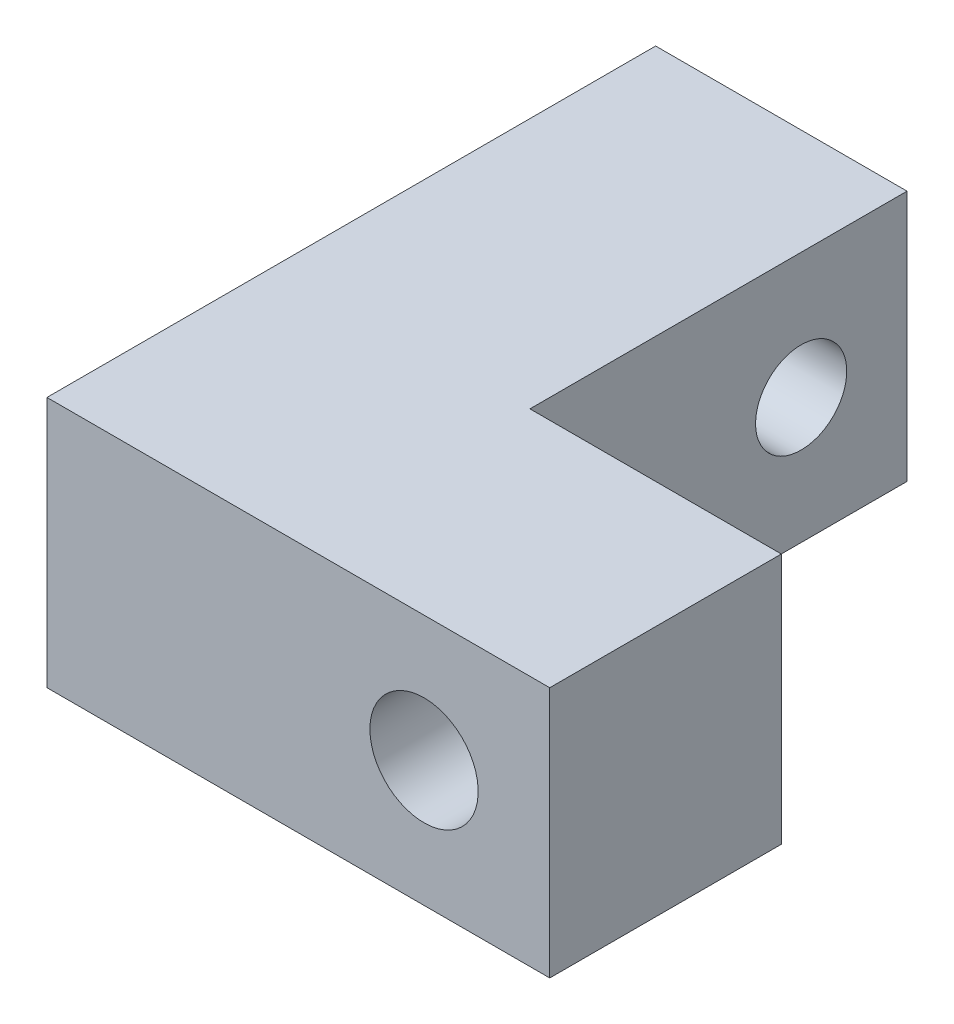
ISO-10303-21;
HEADER;
FILE_DESCRIPTION(('STEP AP214'),'2;1');
FILE_NAME('part.step','',(''),(''),'','','');
FILE_SCHEMA(('AUTOMOTIVE_DESIGN { 1 0 10303 214 1 1 1 1 }'));
ENDSEC;
DATA;
#1=APPLICATION_CONTEXT('core data for automotive mechanical design processes');
#2=APPLICATION_PROTOCOL_DEFINITION('international standard','automotive_design',2000,#1);
#3=PRODUCT_CONTEXT('',#1,'mechanical');
#4=PRODUCT('Part','Part','',(#3));
#5=PRODUCT_RELATED_PRODUCT_CATEGORY('part','',(#4));
#6=PRODUCT_DEFINITION_FORMATION('','',#4);
#7=PRODUCT_DEFINITION_CONTEXT('part definition',#1,'design');
#8=PRODUCT_DEFINITION('design','',#6,#7);
#9=PRODUCT_DEFINITION_SHAPE('','',#8);
#10=(LENGTH_UNIT() NAMED_UNIT(*) SI_UNIT(.MILLI.,.METRE.));
#11=(NAMED_UNIT(*) PLANE_ANGLE_UNIT() SI_UNIT($,.RADIAN.));
#12=(NAMED_UNIT(*) SI_UNIT($,.STERADIAN.) SOLID_ANGLE_UNIT());
#13=UNCERTAINTY_MEASURE_WITH_UNIT(LENGTH_MEASURE(1.E-05),#10,'distance_accuracy_value','');
#14=(GEOMETRIC_REPRESENTATION_CONTEXT(3) GLOBAL_UNCERTAINTY_ASSIGNED_CONTEXT((#13)) GLOBAL_UNIT_ASSIGNED_CONTEXT((#10,
#11,#12)) REPRESENTATION_CONTEXT('',''));
#15=CARTESIAN_POINT('',(0.,0.,0.));
#16=DIRECTION('',(0.,0.,1.));
#17=DIRECTION('',(1.,0.,0.));
#18=AXIS2_PLACEMENT_3D('',#15,#16,#17);
#19=CARTESIAN_POINT('',(19.05,19.05,23.8125));
#20=DIRECTION('',(-1.,0.,0.));
#21=DIRECTION('',(0.,0.,1.));
#22=AXIS2_PLACEMENT_3D('',#19,#20,#21);
#23=PLANE('',#22);
#24=DIRECTION('',(0.,0.,-1.));
#25=VECTOR('',#24,1.);
#26=CARTESIAN_POINT('',(19.05,0.,23.8125));
#27=LINE('',#26,#25);
#28=CARTESIAN_POINT('',(19.05,0.,23.8125));
#29=VERTEX_POINT('',#28);
#30=CARTESIAN_POINT('',(19.05,0.,6.2625));
#31=VERTEX_POINT('',#30);
#32=EDGE_CURVE('E137',#29,#31,#27,.T.);
#33=ORIENTED_EDGE('',*,*,#32,.T.);
#34=DIRECTION('',(0.,1.,0.));
#35=VECTOR('',#34,1.);
#36=CARTESIAN_POINT('',(19.05,19.05,6.2625));
#37=LINE('',#36,#35);
#38=CARTESIAN_POINT('',(19.05,19.05,6.2625));
#39=VERTEX_POINT('',#38);
#40=EDGE_CURVE('E180',#31,#39,#37,.T.);
#41=ORIENTED_EDGE('',*,*,#40,.T.);
#42=DIRECTION('',(0.,0.,-1.));
#43=VECTOR('',#42,1.);
#44=CARTESIAN_POINT('',(19.05,19.05,23.8125));
#45=LINE('',#44,#43);
#46=CARTESIAN_POINT('',(19.05,19.05,23.8125));
#47=VERTEX_POINT('',#46);
#48=EDGE_CURVE('E138',#47,#39,#45,.T.);
#49=ORIENTED_EDGE('',*,*,#48,.F.);
#50=DIRECTION('',(0.,-1.,0.));
#51=VECTOR('',#50,1.);
#52=CARTESIAN_POINT('',(19.05,19.05,23.8125));
#53=LINE('',#52,#51);
#54=EDGE_CURVE('E146',#47,#29,#53,.T.);
#55=ORIENTED_EDGE('',*,*,#54,.T.);
#56=EDGE_LOOP('',(#33,#41,#49,#55));
#57=FACE_BOUND('',#56,.T.);
#58=ADVANCED_FACE('F33',(#57),#23,.F.);
#59=CARTESIAN_POINT('',(-19.05,19.05,-23.8125));
#60=DIRECTION('',(0.,0.,1.));
#61=DIRECTION('',(1.,0.,0.));
#62=AXIS2_PLACEMENT_3D('',#59,#60,#61);
#63=PLANE('',#62);
#64=DIRECTION('',(0.,-1.,0.));
#65=VECTOR('',#64,1.);
#66=CARTESIAN_POINT('',(-1.50000000000003,19.05,-23.8125));
#67=LINE('',#66,#65);
#68=CARTESIAN_POINT('',(-1.50000000000003,17.55,-23.8125));
#69=VERTEX_POINT('',#68);
#70=CARTESIAN_POINT('',(-1.50000000000003,1.50000000000002,-23.8125));
#71=VERTEX_POINT('',#70);
#72=EDGE_CURVE('E50',#69,#71,#67,.T.);
#73=ORIENTED_EDGE('',*,*,#72,.T.);
#74=DIRECTION('',(-1.,0.,0.));
#75=VECTOR('',#74,1.);
#76=CARTESIAN_POINT('',(-19.05,1.50000000000002,-23.8125));
#77=LINE('',#76,#75);
#78=CARTESIAN_POINT('',(-19.05,1.50000000000003,-23.8125));
#79=VERTEX_POINT('',#78);
#80=EDGE_CURVE('E184',#71,#79,#77,.T.);
#81=ORIENTED_EDGE('',*,*,#80,.T.);
#82=DIRECTION('',(0.,-1.,0.));
#83=VECTOR('',#82,1.);
#84=CARTESIAN_POINT('',(-19.05,19.05,-23.8125));
#85=LINE('',#84,#83);
#86=CARTESIAN_POINT('',(-19.05,17.55,-23.8125));
#87=VERTEX_POINT('',#86);
#88=EDGE_CURVE('E157',#87,#79,#85,.T.);
#89=ORIENTED_EDGE('',*,*,#88,.F.);
#90=DIRECTION('',(1.,0.,0.));
#91=VECTOR('',#90,1.);
#92=CARTESIAN_POINT('',(-19.05,17.55,-23.8125));
#93=LINE('',#92,#91);
#94=EDGE_CURVE('E55',#87,#69,#93,.T.);
#95=ORIENTED_EDGE('',*,*,#94,.T.);
#96=EDGE_LOOP('',(#73,#81,#89,#95));
#97=FACE_BOUND('',#96,.T.);
#98=ADVANCED_FACE('F251',(#97),#63,.F.);
#99=CARTESIAN_POINT('',(-19.05,19.05,23.8125));
#100=DIRECTION('',(1.,0.,0.));
#101=DIRECTION('',(0.,0.,-1.));
#102=AXIS2_PLACEMENT_3D('',#99,#100,#101);
#103=PLANE('',#102);
#104=CARTESIAN_POINT('',(-19.05,9.525,-14.2875));
#105=DIRECTION('',(-1.,0.,0.));
#106=DIRECTION('',(0.,0.,1.));
#107=AXIS2_PLACEMENT_3D('',#104,#105,#106);
#108=CIRCLE('',#107,4.60375);
#109=CARTESIAN_POINT('',(-19.05,9.525,-9.68375));
#110=VERTEX_POINT('',#109);
#111=EDGE_CURVE('E437',#110,#110,#108,.T.);
#112=ORIENTED_EDGE('',*,*,#111,.F.);
#113=EDGE_LOOP('',(#112));
#114=FACE_BOUND('',#113,.T.);
#115=CARTESIAN_POINT('',(-19.05,9.525,11.1125));
#116=DIRECTION('',(-1.,0.,0.));
#117=DIRECTION('',(0.,0.,1.));
#118=AXIS2_PLACEMENT_3D('',#115,#116,#117);
#119=CIRCLE('',#118,4.60375);
#120=CARTESIAN_POINT('',(-19.05,9.525,15.71625));
#121=VERTEX_POINT('',#120);
#122=EDGE_CURVE('E129',#121,#121,#119,.T.);
#123=ORIENTED_EDGE('',*,*,#122,.F.);
#124=EDGE_LOOP('',(#123));
#125=FACE_BOUND('',#124,.T.);
#126=ORIENTED_EDGE('',*,*,#88,.T.);
#127=DIRECTION('',(0.,-0.707106781186549,0.707106781186546));
#128=VECTOR('',#127,1.);
#129=CARTESIAN_POINT('',(-19.05,1.50000000000002,-23.8125));
#130=LINE('',#129,#128);
#131=CARTESIAN_POINT('',(-19.05,0.,-22.3125));
#132=VERTEX_POINT('',#131);
#133=EDGE_CURVE('E188',#79,#132,#130,.T.);
#134=ORIENTED_EDGE('',*,*,#133,.T.);
#135=DIRECTION('',(0.,0.,1.));
#136=VECTOR('',#135,1.);
#137=CARTESIAN_POINT('',(-19.05,0.,23.8125));
#138=LINE('',#137,#136);
#139=CARTESIAN_POINT('',(-19.05,0.,23.8125));
#140=VERTEX_POINT('',#139);
#141=EDGE_CURVE('E149',#132,#140,#138,.T.);
#142=ORIENTED_EDGE('',*,*,#141,.T.);
#143=DIRECTION('',(0.,-1.,0.));
#144=VECTOR('',#143,1.);
#145=CARTESIAN_POINT('',(-19.05,19.05,23.8125));
#146=LINE('',#145,#144);
#147=CARTESIAN_POINT('',(-19.05,19.05,23.8125));
#148=VERTEX_POINT('',#147);
#149=EDGE_CURVE('E154',#148,#140,#146,.T.);
#150=ORIENTED_EDGE('',*,*,#149,.F.);
#151=DIRECTION('',(0.,0.,1.));
#152=VECTOR('',#151,1.);
#153=CARTESIAN_POINT('',(-19.05,19.05,23.8125));
#154=LINE('',#153,#152);
#155=CARTESIAN_POINT('',(-19.05,19.05,-22.3125));
#156=VERTEX_POINT('',#155);
#157=EDGE_CURVE('E141',#156,#148,#154,.T.);
#158=ORIENTED_EDGE('',*,*,#157,.F.);
#159=DIRECTION('',(0.,0.707106781186549,0.707106781186546));
#160=VECTOR('',#159,1.);
#161=CARTESIAN_POINT('',(-19.05,19.05,-22.3125));
#162=LINE('',#161,#160);
#163=EDGE_CURVE('E186',#156,#87,#162,.F.);
#164=ORIENTED_EDGE('',*,*,#163,.T.);
#165=EDGE_LOOP('',(#126,#134,#142,#150,#158,#164));
#166=FACE_BOUND('',#165,.T.);
#167=ADVANCED_FACE('F217',(#114,#125,#166),#103,.F.);
#168=CARTESIAN_POINT('',(-19.05,19.05,23.8125));
#169=DIRECTION('',(0.,0.,-1.));
#170=DIRECTION('',(-1.,0.,0.));
#171=AXIS2_PLACEMENT_3D('',#168,#169,#170);
#172=PLANE('',#171);
#173=CARTESIAN_POINT('',(9.525,9.525,23.8125));
#174=DIRECTION('',(0.,0.,-1.));
#175=DIRECTION('',(-1.,0.,0.));
#176=AXIS2_PLACEMENT_3D('',#173,#174,#175);
#177=CIRCLE('',#176,4.1021);
#178=CARTESIAN_POINT('',(5.4229,9.525,23.8125));
#179=VERTEX_POINT('',#178);
#180=EDGE_CURVE('E436',#179,#179,#177,.T.);
#181=ORIENTED_EDGE('',*,*,#180,.T.);
#182=EDGE_LOOP('',(#181));
#183=FACE_BOUND('',#182,.T.);
#184=DIRECTION('',(1.,0.,0.));
#185=VECTOR('',#184,1.);
#186=CARTESIAN_POINT('',(-19.05,0.,23.8125));
#187=LINE('',#186,#185);
#188=EDGE_CURVE('E142',#140,#29,#187,.T.);
#189=ORIENTED_EDGE('',*,*,#188,.T.);
#190=ORIENTED_EDGE('',*,*,#54,.F.);
#191=DIRECTION('',(1.,0.,0.));
#192=VECTOR('',#191,1.);
#193=CARTESIAN_POINT('',(-19.05,19.05,23.8125));
#194=LINE('',#193,#192);
#195=EDGE_CURVE('E144',#148,#47,#194,.T.);
#196=ORIENTED_EDGE('',*,*,#195,.F.);
#197=ORIENTED_EDGE('',*,*,#149,.T.);
#198=EDGE_LOOP('',(#189,#190,#196,#197));
#199=FACE_BOUND('',#198,.T.);
#200=ADVANCED_FACE('F223',(#183,#199),#172,.F.);
#201=CARTESIAN_POINT('',(19.05,19.05,-23.8125));
#202=DIRECTION('',(0.,-1.,0.));
#203=DIRECTION('',(0.,0.,-1.));
#204=AXIS2_PLACEMENT_3D('',#201,#202,#203);
#205=PLANE('',#204);
#206=ORIENTED_EDGE('',*,*,#48,.T.);
#207=DIRECTION('',(-1.,0.,0.));
#208=VECTOR('',#207,1.);
#209=CARTESIAN_POINT('',(19.05,19.05,6.2625));
#210=LINE('',#209,#208);
#211=CARTESIAN_POINT('',(0.,19.05,6.2625));
#212=VERTEX_POINT('',#211);
#213=EDGE_CURVE('E177',#39,#212,#210,.T.);
#214=ORIENTED_EDGE('',*,*,#213,.T.);
#215=DIRECTION('',(0.,0.,1.));
#216=VECTOR('',#215,1.);
#217=CARTESIAN_POINT('',(0.,19.05,-23.8125));
#218=LINE('',#217,#216);
#219=CARTESIAN_POINT('',(0.,19.05,-22.3125));
#220=VERTEX_POINT('',#219);
#221=EDGE_CURVE('E126',#220,#212,#218,.T.);
#222=ORIENTED_EDGE('',*,*,#221,.F.);
#223=DIRECTION('',(-1.,0.,0.));
#224=VECTOR('',#223,1.);
#225=CARTESIAN_POINT('',(19.05,19.05,-22.3125));
#226=LINE('',#225,#224);
#227=EDGE_CURVE('E175',#220,#156,#226,.T.);
#228=ORIENTED_EDGE('',*,*,#227,.T.);
#229=ORIENTED_EDGE('',*,*,#157,.T.);
#230=ORIENTED_EDGE('',*,*,#195,.T.);
#231=EDGE_LOOP('',(#206,#214,#222,#228,#229,#230));
#232=FACE_BOUND('',#231,.T.);
#233=ADVANCED_FACE('F214',(#232),#205,.F.);
#234=CARTESIAN_POINT('',(19.05,0.,-23.8125));
#235=DIRECTION('',(0.,-1.,0.));
#236=DIRECTION('',(0.,0.,-1.));
#237=AXIS2_PLACEMENT_3D('',#234,#235,#236);
#238=PLANE('',#237);
#239=DIRECTION('',(0.,0.,1.));
#240=VECTOR('',#239,1.);
#241=CARTESIAN_POINT('',(0.,0.,-23.8125));
#242=LINE('',#241,#240);
#243=CARTESIAN_POINT('',(0.,0.,-22.3125));
#244=VERTEX_POINT('',#243);
#245=CARTESIAN_POINT('',(0.,0.,6.26250000000001));
#246=VERTEX_POINT('',#245);
#247=EDGE_CURVE('E123',#244,#246,#242,.T.);
#248=ORIENTED_EDGE('',*,*,#247,.T.);
#249=DIRECTION('',(1.,0.,0.));
#250=VECTOR('',#249,1.);
#251=CARTESIAN_POINT('',(19.05,0.,6.2625));
#252=LINE('',#251,#250);
#253=EDGE_CURVE('E166',#246,#31,#252,.T.);
#254=ORIENTED_EDGE('',*,*,#253,.T.);
#255=ORIENTED_EDGE('',*,*,#32,.F.);
#256=ORIENTED_EDGE('',*,*,#188,.F.);
#257=ORIENTED_EDGE('',*,*,#141,.F.);
#258=DIRECTION('',(1.,0.,0.));
#259=VECTOR('',#258,1.);
#260=CARTESIAN_POINT('',(0.,0.,-22.3125));
#261=LINE('',#260,#259);
#262=EDGE_CURVE('E160',#132,#244,#261,.T.);
#263=ORIENTED_EDGE('',*,*,#262,.T.);
#264=EDGE_LOOP('',(#248,#254,#255,#256,#257,#263));
#265=FACE_BOUND('',#264,.T.);
#266=ADVANCED_FACE('F248',(#265),#238,.T.);
#267=CARTESIAN_POINT('',(19.05,-0.001000000000001,4.7625));
#268=DIRECTION('',(0.,0.,1.));
#269=DIRECTION('',(1.,0.,0.));
#270=AXIS2_PLACEMENT_3D('',#267,#268,#269);
#271=PLANE('',#270);
#272=CARTESIAN_POINT('',(9.525,9.525,4.7625));
#273=DIRECTION('',(0.,0.,-1.));
#274=DIRECTION('',(-1.,0.,0.));
#275=AXIS2_PLACEMENT_3D('',#272,#273,#274);
#276=CIRCLE('',#275,4.7371);
#277=CARTESIAN_POINT('',(4.7879,9.525,4.7625));
#278=VERTEX_POINT('',#277);
#279=EDGE_CURVE('E198',#278,#278,#276,.T.);
#280=ORIENTED_EDGE('',*,*,#279,.F.);
#281=EDGE_LOOP('',(#280));
#282=FACE_BOUND('',#281,.T.);
#283=DIRECTION('',(0.,-1.,0.));
#284=VECTOR('',#283,1.);
#285=CARTESIAN_POINT('',(17.55,-0.001000000000001,4.7625));
#286=LINE('',#285,#284);
#287=CARTESIAN_POINT('',(17.55,17.55,4.7625));
#288=VERTEX_POINT('',#287);
#289=CARTESIAN_POINT('',(17.55,1.50000000000001,4.7625));
#290=VERTEX_POINT('',#289);
#291=EDGE_CURVE('E169',#288,#290,#286,.T.);
#292=ORIENTED_EDGE('',*,*,#291,.T.);
#293=DIRECTION('',(-1.,0.,0.));
#294=VECTOR('',#293,1.);
#295=CARTESIAN_POINT('',(0.,1.50000000000001,4.76250000000001));
#296=LINE('',#295,#294);
#297=CARTESIAN_POINT('',(0.,1.50000000000001,4.76250000000001));
#298=VERTEX_POINT('',#297);
#299=EDGE_CURVE('E173',#290,#298,#296,.T.);
#300=ORIENTED_EDGE('',*,*,#299,.T.);
#301=DIRECTION('',(0.,1.,0.));
#302=VECTOR('',#301,1.);
#303=CARTESIAN_POINT('',(0.,-0.001000000000001,4.76250000000001));
#304=LINE('',#303,#302);
#305=CARTESIAN_POINT('',(0.,17.55,4.76250000000001));
#306=VERTEX_POINT('',#305);
#307=EDGE_CURVE('E134',#298,#306,#304,.T.);
#308=ORIENTED_EDGE('',*,*,#307,.T.);
#309=DIRECTION('',(1.,0.,0.));
#310=VECTOR('',#309,1.);
#311=CARTESIAN_POINT('',(19.05,17.55,4.7625));
#312=LINE('',#311,#310);
#313=EDGE_CURVE('E171',#306,#288,#312,.T.);
#314=ORIENTED_EDGE('',*,*,#313,.T.);
#315=EDGE_LOOP('',(#292,#300,#308,#314));
#316=FACE_BOUND('',#315,.T.);
#317=ADVANCED_FACE('F239',(#282,#316),#271,.F.);
#318=CARTESIAN_POINT('',(0.,-0.001000000000001,-23.8125));
#319=DIRECTION('',(-1.,0.,0.));
#320=DIRECTION('',(0.,0.,1.));
#321=AXIS2_PLACEMENT_3D('',#318,#319,#320);
#322=PLANE('',#321);
#323=CARTESIAN_POINT('',(0.,9.525,-14.2875));
#324=DIRECTION('',(-1.,0.,0.));
#325=DIRECTION('',(0.,0.,1.));
#326=AXIS2_PLACEMENT_3D('',#323,#324,#325);
#327=CIRCLE('',#326,3.4544);
#328=CARTESIAN_POINT('',(0.,9.525,-10.8331));
#329=VERTEX_POINT('',#328);
#330=EDGE_CURVE('E161',#329,#329,#327,.T.);
#331=ORIENTED_EDGE('',*,*,#330,.T.);
#332=EDGE_LOOP('',(#331));
#333=FACE_BOUND('',#332,.T.);
#334=ORIENTED_EDGE('',*,*,#247,.F.);
#335=DIRECTION('',(0.,1.,0.));
#336=VECTOR('',#335,1.);
#337=CARTESIAN_POINT('',(0.,-0.001000000000001,-22.3125));
#338=LINE('',#337,#336);
#339=EDGE_CURVE('E190',#244,#220,#338,.T.);
#340=ORIENTED_EDGE('',*,*,#339,.T.);
#341=ORIENTED_EDGE('',*,*,#221,.T.);
#342=DIRECTION('',(0.,0.707106781186549,0.707106781186546));
#343=VECTOR('',#342,1.);
#344=CARTESIAN_POINT('',(0.,-5.51300000000005,-18.3004999999999));
#345=LINE('',#344,#343);
#346=EDGE_CURVE('E11',#212,#306,#345,.F.);
#347=ORIENTED_EDGE('',*,*,#346,.T.);
#348=ORIENTED_EDGE('',*,*,#307,.F.);
#349=DIRECTION('',(0.,-0.707106781186549,0.707106781186546));
#350=VECTOR('',#349,1.);
#351=CARTESIAN_POINT('',(0.,15.037,-8.77449999999993));
#352=LINE('',#351,#350);
#353=EDGE_CURVE('E42',#298,#246,#352,.T.);
#354=ORIENTED_EDGE('',*,*,#353,.T.);
#355=EDGE_LOOP('',(#334,#340,#341,#347,#348,#354));
#356=FACE_BOUND('',#355,.T.);
#357=ADVANCED_FACE('F117',(#333,#356),#322,.F.);
#358=CARTESIAN_POINT('',(0.00999999999999612,9.525,11.1125));
#359=DIRECTION('',(-1.,0.,0.));
#360=DIRECTION('',(0.,0.,1.));
#361=AXIS2_PLACEMENT_3D('',#358,#359,#360);
#362=CONICAL_SURFACE('',#361,3.4544,1.02974425867665);
#363=CARTESIAN_POINT('',(2.0856129223688,9.525,11.1125));
#364=VERTEX_POINT('',#363);
#365=VERTEX_LOOP('',#364);
#366=FACE_BOUND('',#365,.T.);
#367=CARTESIAN_POINT('',(0.00999999999999612,9.525,11.1125));
#368=DIRECTION('',(-1.,0.,0.));
#369=DIRECTION('',(0.,0.,1.));
#370=AXIS2_PLACEMENT_3D('',#367,#368,#369);
#371=CIRCLE('',#370,3.4544);
#372=CARTESIAN_POINT('',(0.00999999999999612,9.525,14.5669));
#373=VERTEX_POINT('',#372);
#374=EDGE_CURVE('E121',#373,#373,#371,.T.);
#375=ORIENTED_EDGE('',*,*,#374,.T.);
#376=EDGE_LOOP('',(#375));
#377=FACE_BOUND('',#376,.T.);
#378=ADVANCED_FACE('F113',(#366,#377),#362,.F.);
#379=CARTESIAN_POINT('',(-19.05,9.525,11.1125));
#380=DIRECTION('',(-1.,0.,0.));
#381=DIRECTION('',(0.,0.,1.));
#382=AXIS2_PLACEMENT_3D('',#379,#380,#381);
#383=CYLINDRICAL_SURFACE('',#382,3.4544);
#384=ORIENTED_EDGE('',*,*,#374,.F.);
#385=EDGE_LOOP('',(#384));
#386=FACE_BOUND('',#385,.T.);
#387=CARTESIAN_POINT('',(-17.90065,9.525,11.1125));
#388=DIRECTION('',(-1.,0.,0.));
#389=DIRECTION('',(0.,0.,1.));
#390=AXIS2_PLACEMENT_3D('',#387,#388,#389);
#391=CIRCLE('',#390,3.4544);
#392=CARTESIAN_POINT('',(-17.90065,9.525,14.5669));
#393=VERTEX_POINT('',#392);
#394=EDGE_CURVE('E124',#393,#393,#391,.T.);
#395=ORIENTED_EDGE('',*,*,#394,.T.);
#396=EDGE_LOOP('',(#395));
#397=FACE_BOUND('',#396,.T.);
#398=ADVANCED_FACE('F116',(#386,#397),#383,.F.);
#399=CARTESIAN_POINT('',(-19.05,9.525,11.1125));
#400=DIRECTION('',(-1.,0.,0.));
#401=DIRECTION('',(0.,0.,1.));
#402=AXIS2_PLACEMENT_3D('',#399,#400,#401);
#403=CONICAL_SURFACE('',#402,4.60375,0.785398163397447);
#404=ORIENTED_EDGE('',*,*,#394,.F.);
#405=EDGE_LOOP('',(#404));
#406=FACE_BOUND('',#405,.T.);
#407=ORIENTED_EDGE('',*,*,#122,.T.);
#408=EDGE_LOOP('',(#407));
#409=FACE_BOUND('',#408,.T.);
#410=ADVANCED_FACE('F323',(#406,#409),#403,.F.);
#411=CARTESIAN_POINT('',(-19.05,9.525,-14.2875));
#412=DIRECTION('',(-1.,0.,0.));
#413=DIRECTION('',(0.,0.,1.));
#414=AXIS2_PLACEMENT_3D('',#411,#412,#413);
#415=CYLINDRICAL_SURFACE('',#414,3.4544);
#416=CARTESIAN_POINT('',(-17.90065,9.525,-14.2875));
#417=DIRECTION('',(-1.,0.,0.));
#418=DIRECTION('',(0.,0.,1.));
#419=AXIS2_PLACEMENT_3D('',#416,#417,#418);
#420=CIRCLE('',#419,3.4544);
#421=CARTESIAN_POINT('',(-17.90065,9.525,-10.8331));
#422=VERTEX_POINT('',#421);
#423=EDGE_CURVE('E164',#422,#422,#420,.T.);
#424=ORIENTED_EDGE('',*,*,#423,.T.);
#425=EDGE_LOOP('',(#424));
#426=FACE_BOUND('',#425,.T.);
#427=ORIENTED_EDGE('',*,*,#330,.F.);
#428=EDGE_LOOP('',(#427));
#429=FACE_BOUND('',#428,.T.);
#430=ADVANCED_FACE('F314',(#426,#429),#415,.F.);
#431=CARTESIAN_POINT('',(-19.05,9.525,-14.2875));
#432=DIRECTION('',(-1.,0.,0.));
#433=DIRECTION('',(0.,0.,1.));
#434=AXIS2_PLACEMENT_3D('',#431,#432,#433);
#435=CONICAL_SURFACE('',#434,4.60375,0.785398163397447);
#436=ORIENTED_EDGE('',*,*,#423,.F.);
#437=EDGE_LOOP('',(#436));
#438=FACE_BOUND('',#437,.T.);
#439=ORIENTED_EDGE('',*,*,#111,.T.);
#440=EDGE_LOOP('',(#439));
#441=FACE_BOUND('',#440,.T.);
#442=ADVANCED_FACE('F305',(#438,#441),#435,.F.);
#443=CARTESIAN_POINT('',(9.525,9.525,4.76250000000001));
#444=DIRECTION('',(0.,0.,-1.));
#445=DIRECTION('',(-1.,0.,0.));
#446=AXIS2_PLACEMENT_3D('',#443,#444,#445);
#447=CYLINDRICAL_SURFACE('',#446,4.1021);
#448=ORIENTED_EDGE('',*,*,#180,.F.);
#449=EDGE_LOOP('',(#448));
#450=FACE_BOUND('',#449,.T.);
#451=CARTESIAN_POINT('',(9.525,9.525,5.39750000000001));
#452=DIRECTION('',(0.,0.,-1.));
#453=DIRECTION('',(-1.,0.,0.));
#454=AXIS2_PLACEMENT_3D('',#451,#452,#453);
#455=CIRCLE('',#454,4.1021);
#456=CARTESIAN_POINT('',(5.4229,9.525,5.39750000000001));
#457=VERTEX_POINT('',#456);
#458=EDGE_CURVE('E438',#457,#457,#455,.T.);
#459=ORIENTED_EDGE('',*,*,#458,.T.);
#460=EDGE_LOOP('',(#459));
#461=FACE_BOUND('',#460,.T.);
#462=ADVANCED_FACE('F296',(#450,#461),#447,.F.);
#463=CARTESIAN_POINT('',(9.525,9.525,4.7625));
#464=DIRECTION('',(0.,0.,-1.));
#465=DIRECTION('',(-1.,0.,0.));
#466=AXIS2_PLACEMENT_3D('',#463,#464,#465);
#467=CONICAL_SURFACE('',#466,4.7371,0.785398163397446);
#468=ORIENTED_EDGE('',*,*,#458,.F.);
#469=EDGE_LOOP('',(#468));
#470=FACE_BOUND('',#469,.T.);
#471=ORIENTED_EDGE('',*,*,#279,.T.);
#472=EDGE_LOOP('',(#471));
#473=FACE_BOUND('',#472,.T.);
#474=ADVANCED_FACE('F269',(#470,#473),#467,.F.);
#475=CARTESIAN_POINT('',(19.05,17.55,4.7625));
#476=DIRECTION('',(0.,-0.707106781186546,0.707106781186549));
#477=DIRECTION('',(0.,-0.707106781186549,-0.707106781186546));
#478=AXIS2_PLACEMENT_3D('',#475,#476,#477);
#479=PLANE('',#478);
#480=ORIENTED_EDGE('',*,*,#346,.F.);
#481=ORIENTED_EDGE('',*,*,#213,.F.);
#482=DIRECTION('',(0.577350269189627,0.577350269189627,0.577350269189624));
#483=VECTOR('',#482,1.);
#484=CARTESIAN_POINT('',(19.05,19.05,6.2625));
#485=LINE('',#484,#483);
#486=EDGE_CURVE('E196',#288,#39,#485,.T.);
#487=ORIENTED_EDGE('',*,*,#486,.F.);
#488=ORIENTED_EDGE('',*,*,#313,.F.);
#489=EDGE_LOOP('',(#480,#481,#487,#488));
#490=FACE_BOUND('',#489,.T.);
#491=ADVANCED_FACE('F230',(#490),#479,.F.);
#492=CARTESIAN_POINT('',(19.05,19.05,6.2625));
#493=DIRECTION('',(-0.707106781186546,0.,0.707106781186549));
#494=DIRECTION('',(0.707106781186549,0.,0.707106781186546));
#495=AXIS2_PLACEMENT_3D('',#492,#493,#494);
#496=PLANE('',#495);
#497=ORIENTED_EDGE('',*,*,#486,.T.);
#498=ORIENTED_EDGE('',*,*,#40,.F.);
#499=DIRECTION('',(0.577350269189627,-0.577350269189627,0.577350269189624));
#500=VECTOR('',#499,1.);
#501=CARTESIAN_POINT('',(12.7,6.35000000000002,-0.0874999999999878));
#502=LINE('',#501,#500);
#503=EDGE_CURVE('E194',#290,#31,#502,.T.);
#504=ORIENTED_EDGE('',*,*,#503,.F.);
#505=ORIENTED_EDGE('',*,*,#291,.F.);
#506=EDGE_LOOP('',(#497,#498,#504,#505));
#507=FACE_BOUND('',#506,.T.);
#508=ADVANCED_FACE('F235',(#507),#496,.F.);
#509=CARTESIAN_POINT('',(19.05,0.,6.2625));
#510=DIRECTION('',(0.,-0.707106781186546,-0.707106781186549));
#511=DIRECTION('',(0.,0.707106781186549,-0.707106781186546));
#512=AXIS2_PLACEMENT_3D('',#509,#510,#511);
#513=PLANE('',#512);
#514=ORIENTED_EDGE('',*,*,#353,.F.);
#515=ORIENTED_EDGE('',*,*,#299,.F.);
#516=ORIENTED_EDGE('',*,*,#503,.T.);
#517=ORIENTED_EDGE('',*,*,#253,.F.);
#518=EDGE_LOOP('',(#514,#515,#516,#517));
#519=FACE_BOUND('',#518,.T.);
#520=ADVANCED_FACE('F243',(#519),#513,.T.);
#521=CARTESIAN_POINT('',(19.05,19.05,-22.3125));
#522=DIRECTION('',(0.,-0.707106781186546,0.707106781186549));
#523=DIRECTION('',(0.,-0.707106781186549,-0.707106781186546));
#524=AXIS2_PLACEMENT_3D('',#521,#522,#523);
#525=PLANE('',#524);
#526=ORIENTED_EDGE('',*,*,#163,.F.);
#527=ORIENTED_EDGE('',*,*,#227,.F.);
#528=DIRECTION('',(0.577350269189627,0.577350269189627,0.577350269189624));
#529=VECTOR('',#528,1.);
#530=CARTESIAN_POINT('',(-6.35033333333336,12.6996666666666,-28.6628333333333));
#531=LINE('',#530,#529);
#532=EDGE_CURVE('E37',#69,#220,#531,.T.);
#533=ORIENTED_EDGE('',*,*,#532,.F.);
#534=ORIENTED_EDGE('',*,*,#94,.F.);
#535=EDGE_LOOP('',(#526,#527,#533,#534));
#536=FACE_BOUND('',#535,.T.);
#537=ADVANCED_FACE('F35',(#536),#525,.F.);
#538=CARTESIAN_POINT('',(0.,-0.001000000000001,-22.3125));
#539=DIRECTION('',(-0.707106781186546,0.,0.707106781186549));
#540=DIRECTION('',(0.707106781186549,0.,0.707106781186546));
#541=AXIS2_PLACEMENT_3D('',#538,#539,#540);
#542=PLANE('',#541);
#543=ORIENTED_EDGE('',*,*,#532,.T.);
#544=ORIENTED_EDGE('',*,*,#339,.F.);
#545=DIRECTION('',(0.577350269189627,-0.577350269189627,0.577350269189624));
#546=VECTOR('',#545,1.);
#547=CARTESIAN_POINT('',(0.000333333333330437,-0.000333333333333555,-22.3121666666667));
#548=LINE('',#547,#546);
#549=EDGE_CURVE('E199',#71,#244,#548,.T.);
#550=ORIENTED_EDGE('',*,*,#549,.F.);
#551=ORIENTED_EDGE('',*,*,#72,.F.);
#552=EDGE_LOOP('',(#543,#544,#550,#551));
#553=FACE_BOUND('',#552,.T.);
#554=ADVANCED_FACE('F207',(#553),#542,.F.);
#555=CARTESIAN_POINT('',(-19.05,1.50000000000002,-23.8125));
#556=DIRECTION('',(0.,-0.707106781186546,-0.707106781186549));
#557=DIRECTION('',(0.,0.707106781186549,-0.707106781186546));
#558=AXIS2_PLACEMENT_3D('',#555,#556,#557);
#559=PLANE('',#558);
#560=ORIENTED_EDGE('',*,*,#549,.T.);
#561=ORIENTED_EDGE('',*,*,#262,.F.);
#562=ORIENTED_EDGE('',*,*,#133,.F.);
#563=ORIENTED_EDGE('',*,*,#80,.F.);
#564=EDGE_LOOP('',(#560,#561,#562,#563));
#565=FACE_BOUND('',#564,.T.);
#566=ADVANCED_FACE('F250',(#565),#559,.T.);
#567=CLOSED_SHELL('',(#58,#98,#167,#200,#233,#266,#317,#357,#378,#398,#410,#430,#442,#462,#474,
#491,#508,#520,#537,#554,#566));
#568=MANIFOLD_SOLID_BREP('B2',#567);
#569=ADVANCED_BREP_SHAPE_REPRESENTATION('',(#18,#568),#14);
#570=SHAPE_DEFINITION_REPRESENTATION(#9,#569);
ENDSEC;
END-ISO-10303-21;
